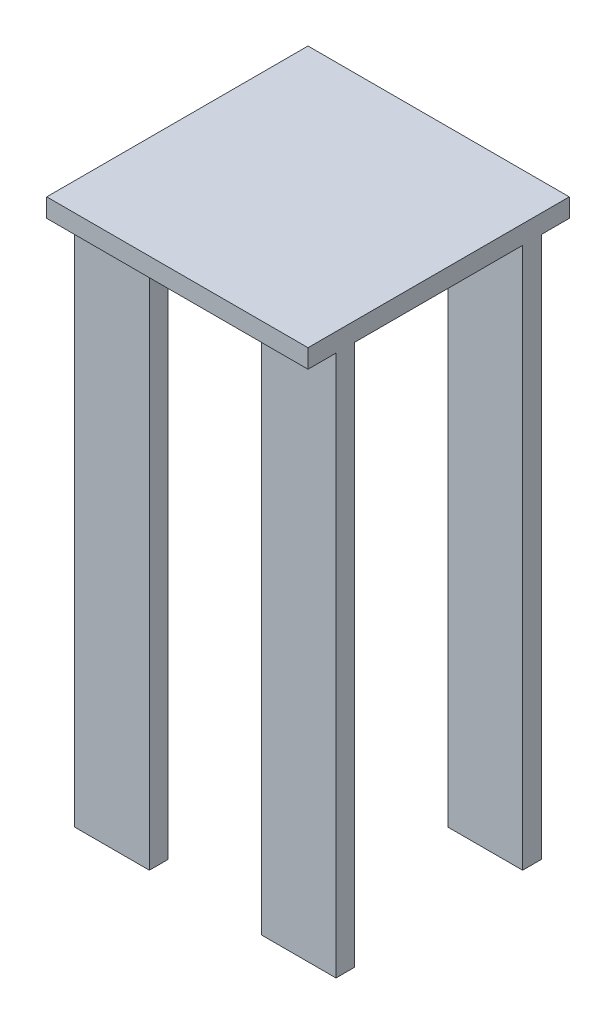
ISO-10303-21;
HEADER;
FILE_DESCRIPTION(('STEP AP214'),'2;1');
FILE_NAME('part.step','',(''),(''),'','','');
FILE_SCHEMA(('AUTOMOTIVE_DESIGN { 1 0 10303 214 1 1 1 1 }'));
ENDSEC;
DATA;
#1=APPLICATION_CONTEXT('core data for automotive mechanical design processes');
#2=APPLICATION_PROTOCOL_DEFINITION('international standard','automotive_design',2000,#1);
#3=PRODUCT_CONTEXT('',#1,'mechanical');
#4=PRODUCT('Part','Part','',(#3));
#5=PRODUCT_RELATED_PRODUCT_CATEGORY('part','',(#4));
#6=PRODUCT_DEFINITION_FORMATION('','',#4);
#7=PRODUCT_DEFINITION_CONTEXT('part definition',#1,'design');
#8=PRODUCT_DEFINITION('design','',#6,#7);
#9=PRODUCT_DEFINITION_SHAPE('','',#8);
#10=(LENGTH_UNIT() NAMED_UNIT(*) SI_UNIT(.MILLI.,.METRE.));
#11=(NAMED_UNIT(*) PLANE_ANGLE_UNIT() SI_UNIT($,.RADIAN.));
#12=(NAMED_UNIT(*) SI_UNIT($,.STERADIAN.) SOLID_ANGLE_UNIT());
#13=UNCERTAINTY_MEASURE_WITH_UNIT(LENGTH_MEASURE(1.E-05),#10,'distance_accuracy_value','');
#14=(GEOMETRIC_REPRESENTATION_CONTEXT(3) GLOBAL_UNCERTAINTY_ASSIGNED_CONTEXT((#13)) GLOBAL_UNIT_ASSIGNED_CONTEXT((#10,
#11,#12)) REPRESENTATION_CONTEXT('',''));
#15=CARTESIAN_POINT('',(0.,0.,0.));
#16=DIRECTION('',(0.,0.,1.));
#17=DIRECTION('',(1.,0.,0.));
#18=AXIS2_PLACEMENT_3D('',#15,#16,#17);
#19=CARTESIAN_POINT('',(-0.381,-3.175,-0.5715));
#20=DIRECTION('',(1.,0.,0.));
#21=DIRECTION('',(0.,0.,-1.));
#22=AXIS2_PLACEMENT_3D('',#19,#20,#21);
#23=PLANE('',#22);
#24=DIRECTION('',(0.,0.,-1.));
#25=VECTOR('',#24,1.);
#26=CARTESIAN_POINT('',(-0.381,0.635,-0.5715));
#27=LINE('',#26,#25);
#28=CARTESIAN_POINT('',(-0.381,0.635,-0.6985));
#29=VERTEX_POINT('',#28);
#30=CARTESIAN_POINT('',(-0.381,0.635,-0.5715));
#31=VERTEX_POINT('',#30);
#32=EDGE_CURVE('E20',#29,#31,#27,.F.);
#33=ORIENTED_EDGE('',*,*,#32,.T.);
#34=DIRECTION('',(0.,1.,0.));
#35=VECTOR('',#34,1.);
#36=CARTESIAN_POINT('',(-0.381,-3.175,-0.5715));
#37=LINE('',#36,#35);
#38=CARTESIAN_POINT('',(-0.381,-3.048,-0.5715));
#39=VERTEX_POINT('',#38);
#40=EDGE_CURVE('E160',#39,#31,#37,.T.);
#41=ORIENTED_EDGE('',*,*,#40,.F.);
#42=DIRECTION('',(0.,0.,1.));
#43=VECTOR('',#42,1.);
#44=CARTESIAN_POINT('',(-0.381,-3.048,0.));
#45=LINE('',#44,#43);
#46=CARTESIAN_POINT('',(-0.381,-3.048,-0.6985));
#47=VERTEX_POINT('',#46);
#48=EDGE_CURVE('E152',#39,#47,#45,.F.);
#49=ORIENTED_EDGE('',*,*,#48,.T.);
#50=DIRECTION('',(0.,1.,0.));
#51=VECTOR('',#50,1.);
#52=CARTESIAN_POINT('',(-0.381,-3.175,-0.6985));
#53=LINE('',#52,#51);
#54=EDGE_CURVE('E157',#29,#47,#53,.F.);
#55=ORIENTED_EDGE('',*,*,#54,.F.);
#56=EDGE_LOOP('',(#33,#41,#49,#55));
#57=FACE_BOUND('',#56,.T.);
#58=ADVANCED_FACE('F17',(#57),#23,.T.);
#59=CARTESIAN_POINT('',(-0.381,-3.175,0.6985));
#60=DIRECTION('',(1.,0.,0.));
#61=DIRECTION('',(0.,0.,-1.));
#62=AXIS2_PLACEMENT_3D('',#59,#60,#61);
#63=PLANE('',#62);
#64=DIRECTION('',(0.,0.,-1.));
#65=VECTOR('',#64,1.);
#66=CARTESIAN_POINT('',(-0.381,0.635,0.6985));
#67=LINE('',#66,#65);
#68=CARTESIAN_POINT('',(-0.381,0.635,0.5715));
#69=VERTEX_POINT('',#68);
#70=CARTESIAN_POINT('',(-0.381,0.635,0.6985));
#71=VERTEX_POINT('',#70);
#72=EDGE_CURVE('E169',#69,#71,#67,.F.);
#73=ORIENTED_EDGE('',*,*,#72,.T.);
#74=DIRECTION('',(0.,1.,0.));
#75=VECTOR('',#74,1.);
#76=CARTESIAN_POINT('',(-0.381,-3.175,0.6985));
#77=LINE('',#76,#75);
#78=CARTESIAN_POINT('',(-0.381,-3.048,0.6985));
#79=VERTEX_POINT('',#78);
#80=EDGE_CURVE('E218',#79,#71,#77,.T.);
#81=ORIENTED_EDGE('',*,*,#80,.F.);
#82=DIRECTION('',(0.,0.,1.));
#83=VECTOR('',#82,1.);
#84=CARTESIAN_POINT('',(-0.381,-3.048,0.));
#85=LINE('',#84,#83);
#86=CARTESIAN_POINT('',(-0.381,-3.048,0.5715));
#87=VERTEX_POINT('',#86);
#88=EDGE_CURVE('E225',#79,#87,#85,.F.);
#89=ORIENTED_EDGE('',*,*,#88,.T.);
#90=DIRECTION('',(0.,1.,0.));
#91=VECTOR('',#90,1.);
#92=CARTESIAN_POINT('',(-0.381,-3.175,0.5715));
#93=LINE('',#92,#91);
#94=EDGE_CURVE('E190',#69,#87,#93,.F.);
#95=ORIENTED_EDGE('',*,*,#94,.F.);
#96=EDGE_LOOP('',(#73,#81,#89,#95));
#97=FACE_BOUND('',#96,.T.);
#98=ADVANCED_FACE('F556',(#97),#63,.T.);
#99=CARTESIAN_POINT('',(0.381,-3.175,0.5715));
#100=DIRECTION('',(-1.,0.,0.));
#101=DIRECTION('',(0.,0.,1.));
#102=AXIS2_PLACEMENT_3D('',#99,#100,#101);
#103=PLANE('',#102);
#104=DIRECTION('',(0.,0.,1.));
#105=VECTOR('',#104,1.);
#106=CARTESIAN_POINT('',(0.381,0.635,0.));
#107=LINE('',#106,#105);
#108=CARTESIAN_POINT('',(0.381,0.635,0.6985));
#109=VERTEX_POINT('',#108);
#110=CARTESIAN_POINT('',(0.381,0.635,0.5715));
#111=VERTEX_POINT('',#110);
#112=EDGE_CURVE('E209',#109,#111,#107,.F.);
#113=ORIENTED_EDGE('',*,*,#112,.T.);
#114=DIRECTION('',(0.,1.,0.));
#115=VECTOR('',#114,1.);
#116=CARTESIAN_POINT('',(0.381,-3.175,0.5715));
#117=LINE('',#116,#115);
#118=CARTESIAN_POINT('',(0.381,-3.048,0.5715));
#119=VERTEX_POINT('',#118);
#120=EDGE_CURVE('E287',#119,#111,#117,.T.);
#121=ORIENTED_EDGE('',*,*,#120,.F.);
#122=DIRECTION('',(0.,0.,1.));
#123=VECTOR('',#122,1.);
#124=CARTESIAN_POINT('',(0.381,-3.048,0.));
#125=LINE('',#124,#123);
#126=CARTESIAN_POINT('',(0.381,-3.048,0.6985));
#127=VERTEX_POINT('',#126);
#128=EDGE_CURVE('E295',#119,#127,#125,.T.);
#129=ORIENTED_EDGE('',*,*,#128,.T.);
#130=DIRECTION('',(0.,1.,0.));
#131=VECTOR('',#130,1.);
#132=CARTESIAN_POINT('',(0.381,-3.175,0.6985));
#133=LINE('',#132,#131);
#134=EDGE_CURVE('E198',#109,#127,#133,.F.);
#135=ORIENTED_EDGE('',*,*,#134,.F.);
#136=EDGE_LOOP('',(#113,#121,#129,#135));
#137=FACE_BOUND('',#136,.T.);
#138=ADVANCED_FACE('F546',(#137),#103,.T.);
#139=CARTESIAN_POINT('',(0.381,-3.175,-0.6985));
#140=DIRECTION('',(-1.,0.,0.));
#141=DIRECTION('',(0.,0.,1.));
#142=AXIS2_PLACEMENT_3D('',#139,#140,#141);
#143=PLANE('',#142);
#144=DIRECTION('',(0.,0.,1.));
#145=VECTOR('',#144,1.);
#146=CARTESIAN_POINT('',(0.381,0.635,0.));
#147=LINE('',#146,#145);
#148=CARTESIAN_POINT('',(0.381,0.635,-0.5715));
#149=VERTEX_POINT('',#148);
#150=CARTESIAN_POINT('',(0.381,0.635,-0.6985));
#151=VERTEX_POINT('',#150);
#152=EDGE_CURVE('E205',#149,#151,#147,.F.);
#153=ORIENTED_EDGE('',*,*,#152,.T.);
#154=DIRECTION('',(0.,1.,0.));
#155=VECTOR('',#154,1.);
#156=CARTESIAN_POINT('',(0.381,-3.175,-0.6985));
#157=LINE('',#156,#155);
#158=CARTESIAN_POINT('',(0.381,-3.048,-0.6985));
#159=VERTEX_POINT('',#158);
#160=EDGE_CURVE('E268',#159,#151,#157,.T.);
#161=ORIENTED_EDGE('',*,*,#160,.F.);
#162=DIRECTION('',(0.,0.,1.));
#163=VECTOR('',#162,1.);
#164=CARTESIAN_POINT('',(0.381,-3.048,0.));
#165=LINE('',#164,#163);
#166=CARTESIAN_POINT('',(0.381,-3.048,-0.5715));
#167=VERTEX_POINT('',#166);
#168=EDGE_CURVE('E276',#159,#167,#165,.T.);
#169=ORIENTED_EDGE('',*,*,#168,.T.);
#170=DIRECTION('',(0.,1.,0.));
#171=VECTOR('',#170,1.);
#172=CARTESIAN_POINT('',(0.381,-3.175,-0.5715));
#173=LINE('',#172,#171);
#174=EDGE_CURVE('E278',#149,#167,#173,.F.);
#175=ORIENTED_EDGE('',*,*,#174,.F.);
#176=EDGE_LOOP('',(#153,#161,#169,#175));
#177=FACE_BOUND('',#176,.T.);
#178=ADVANCED_FACE('F537',(#177),#143,.T.);
#179=CARTESIAN_POINT('',(-0.381,-3.175,-0.6985));
#180=DIRECTION('',(0.,0.,-1.));
#181=DIRECTION('',(-1.,0.,0.));
#182=AXIS2_PLACEMENT_3D('',#179,#180,#181);
#183=PLANE('',#182);
#184=DIRECTION('',(1.,0.,0.));
#185=VECTOR('',#184,1.);
#186=CARTESIAN_POINT('',(0.,0.635,-0.6985));
#187=LINE('',#186,#185);
#188=CARTESIAN_POINT('',(-0.889,0.635,-0.6985));
#189=VERTEX_POINT('',#188);
#190=EDGE_CURVE('E168',#189,#29,#187,.T.);
#191=ORIENTED_EDGE('',*,*,#190,.T.);
#192=ORIENTED_EDGE('',*,*,#54,.T.);
#193=DIRECTION('',(1.,0.,0.));
#194=VECTOR('',#193,1.);
#195=CARTESIAN_POINT('',(0.,-3.048,-0.6985));
#196=LINE('',#195,#194);
#197=CARTESIAN_POINT('',(-0.889,-3.048,-0.6985));
#198=VERTEX_POINT('',#197);
#199=EDGE_CURVE('E162',#47,#198,#196,.F.);
#200=ORIENTED_EDGE('',*,*,#199,.T.);
#201=DIRECTION('',(0.,1.,0.));
#202=VECTOR('',#201,1.);
#203=CARTESIAN_POINT('',(-0.889,-3.048,-0.6985));
#204=LINE('',#203,#202);
#205=EDGE_CURVE('E252',#189,#198,#204,.F.);
#206=ORIENTED_EDGE('',*,*,#205,.F.);
#207=EDGE_LOOP('',(#191,#192,#200,#206));
#208=FACE_BOUND('',#207,.T.);
#209=ADVANCED_FACE('F165',(#208),#183,.T.);
#210=CARTESIAN_POINT('',(0.,-3.048,0.));
#211=DIRECTION('',(0.,1.,0.));
#212=DIRECTION('',(0.,0.,1.));
#213=AXIS2_PLACEMENT_3D('',#210,#211,#212);
#214=PLANE('',#213);
#215=ORIENTED_EDGE('',*,*,#48,.F.);
#216=DIRECTION('',(1.,0.,0.));
#217=VECTOR('',#216,1.);
#218=CARTESIAN_POINT('',(-0.889,-3.048,-0.5715));
#219=LINE('',#218,#217);
#220=CARTESIAN_POINT('',(-0.889,-3.048,-0.5715));
#221=VERTEX_POINT('',#220);
#222=EDGE_CURVE('E175',#221,#39,#219,.T.);
#223=ORIENTED_EDGE('',*,*,#222,.F.);
#224=DIRECTION('',(0.,0.,1.));
#225=VECTOR('',#224,1.);
#226=CARTESIAN_POINT('',(-0.889,-3.048,-0.889));
#227=LINE('',#226,#225);
#228=EDGE_CURVE('E173',#198,#221,#227,.T.);
#229=ORIENTED_EDGE('',*,*,#228,.F.);
#230=ORIENTED_EDGE('',*,*,#199,.F.);
#231=EDGE_LOOP('',(#215,#223,#229,#230));
#232=FACE_BOUND('',#231,.T.);
#233=ADVANCED_FACE('F171',(#232),#214,.F.);
#234=CARTESIAN_POINT('',(-0.889,-3.175,-0.5715));
#235=DIRECTION('',(0.,0.,1.));
#236=DIRECTION('',(1.,0.,0.));
#237=AXIS2_PLACEMENT_3D('',#234,#235,#236);
#238=PLANE('',#237);
#239=DIRECTION('',(1.,0.,0.));
#240=VECTOR('',#239,1.);
#241=CARTESIAN_POINT('',(0.,0.635,-0.5715));
#242=LINE('',#241,#240);
#243=CARTESIAN_POINT('',(-0.889,0.635,-0.5715));
#244=VERTEX_POINT('',#243);
#245=EDGE_CURVE('E188',#31,#244,#242,.F.);
#246=ORIENTED_EDGE('',*,*,#245,.T.);
#247=DIRECTION('',(0.,1.,0.));
#248=VECTOR('',#247,1.);
#249=CARTESIAN_POINT('',(-0.889,-3.048,-0.5715));
#250=LINE('',#249,#248);
#251=EDGE_CURVE('E246',#221,#244,#250,.T.);
#252=ORIENTED_EDGE('',*,*,#251,.F.);
#253=ORIENTED_EDGE('',*,*,#222,.T.);
#254=ORIENTED_EDGE('',*,*,#40,.T.);
#255=EDGE_LOOP('',(#246,#252,#253,#254));
#256=FACE_BOUND('',#255,.T.);
#257=ADVANCED_FACE('F186',(#256),#238,.T.);
#258=CARTESIAN_POINT('',(-0.381,-3.175,0.5715));
#259=DIRECTION('',(0.,0.,-1.));
#260=DIRECTION('',(-1.,0.,0.));
#261=AXIS2_PLACEMENT_3D('',#258,#259,#260);
#262=PLANE('',#261);
#263=DIRECTION('',(1.,0.,0.));
#264=VECTOR('',#263,1.);
#265=CARTESIAN_POINT('',(0.,0.635,0.5715));
#266=LINE('',#265,#264);
#267=CARTESIAN_POINT('',(-0.889,0.635,0.5715));
#268=VERTEX_POINT('',#267);
#269=EDGE_CURVE('E215',#268,#69,#266,.T.);
#270=ORIENTED_EDGE('',*,*,#269,.T.);
#271=ORIENTED_EDGE('',*,*,#94,.T.);
#272=DIRECTION('',(1.,0.,0.));
#273=VECTOR('',#272,1.);
#274=CARTESIAN_POINT('',(0.,-3.048,0.5715));
#275=LINE('',#274,#273);
#276=CARTESIAN_POINT('',(-0.889,-3.048,0.5715));
#277=VERTEX_POINT('',#276);
#278=EDGE_CURVE('E223',#87,#277,#275,.F.);
#279=ORIENTED_EDGE('',*,*,#278,.T.);
#280=DIRECTION('',(0.,1.,0.));
#281=VECTOR('',#280,1.);
#282=CARTESIAN_POINT('',(-0.889,-3.048,0.5715));
#283=LINE('',#282,#281);
#284=EDGE_CURVE('E242',#268,#277,#283,.F.);
#285=ORIENTED_EDGE('',*,*,#284,.F.);
#286=EDGE_LOOP('',(#270,#271,#279,#285));
#287=FACE_BOUND('',#286,.T.);
#288=ADVANCED_FACE('F230',(#287),#262,.T.);
#289=CARTESIAN_POINT('',(0.,-3.048,0.));
#290=DIRECTION('',(0.,1.,0.));
#291=DIRECTION('',(0.,0.,1.));
#292=AXIS2_PLACEMENT_3D('',#289,#290,#291);
#293=PLANE('',#292);
#294=ORIENTED_EDGE('',*,*,#88,.F.);
#295=DIRECTION('',(1.,0.,0.));
#296=VECTOR('',#295,1.);
#297=CARTESIAN_POINT('',(-0.889,-3.048,0.6985));
#298=LINE('',#297,#296);
#299=CARTESIAN_POINT('',(-0.889,-3.048,0.6985));
#300=VERTEX_POINT('',#299);
#301=EDGE_CURVE('E220',#300,#79,#298,.T.);
#302=ORIENTED_EDGE('',*,*,#301,.F.);
#303=DIRECTION('',(0.,0.,1.));
#304=VECTOR('',#303,1.);
#305=CARTESIAN_POINT('',(-0.889,-3.048,-0.889));
#306=LINE('',#305,#304);
#307=EDGE_CURVE('E236',#277,#300,#306,.T.);
#308=ORIENTED_EDGE('',*,*,#307,.F.);
#309=ORIENTED_EDGE('',*,*,#278,.F.);
#310=EDGE_LOOP('',(#294,#302,#308,#309));
#311=FACE_BOUND('',#310,.T.);
#312=ADVANCED_FACE('F234',(#311),#293,.F.);
#313=CARTESIAN_POINT('',(-0.889,-3.175,0.6985));
#314=DIRECTION('',(0.,0.,1.));
#315=DIRECTION('',(1.,0.,0.));
#316=AXIS2_PLACEMENT_3D('',#313,#314,#315);
#317=PLANE('',#316);
#318=DIRECTION('',(1.,0.,0.));
#319=VECTOR('',#318,1.);
#320=CARTESIAN_POINT('',(0.,0.635,0.6985));
#321=LINE('',#320,#319);
#322=CARTESIAN_POINT('',(-0.889,0.635,0.6985));
#323=VERTEX_POINT('',#322);
#324=EDGE_CURVE('E213',#71,#323,#321,.F.);
#325=ORIENTED_EDGE('',*,*,#324,.T.);
#326=DIRECTION('',(0.,1.,0.));
#327=VECTOR('',#326,1.);
#328=CARTESIAN_POINT('',(-0.889,-3.048,0.6985));
#329=LINE('',#328,#327);
#330=EDGE_CURVE('E241',#300,#323,#329,.T.);
#331=ORIENTED_EDGE('',*,*,#330,.F.);
#332=ORIENTED_EDGE('',*,*,#301,.T.);
#333=ORIENTED_EDGE('',*,*,#80,.T.);
#334=EDGE_LOOP('',(#325,#331,#332,#333));
#335=FACE_BOUND('',#334,.T.);
#336=ADVANCED_FACE('F332',(#335),#317,.T.);
#337=CARTESIAN_POINT('',(0.,0.635,0.));
#338=DIRECTION('',(0.,1.,0.));
#339=DIRECTION('',(0.,0.,1.));
#340=AXIS2_PLACEMENT_3D('',#337,#338,#339);
#341=PLANE('',#340);
#342=ORIENTED_EDGE('',*,*,#245,.F.);
#343=ORIENTED_EDGE('',*,*,#32,.F.);
#344=ORIENTED_EDGE('',*,*,#190,.F.);
#345=DIRECTION('',(0.,0.,1.));
#346=VECTOR('',#345,1.);
#347=CARTESIAN_POINT('',(-0.889,0.635,-0.889));
#348=LINE('',#347,#346);
#349=CARTESIAN_POINT('',(-0.889,0.635,-0.889));
#350=VERTEX_POINT('',#349);
#351=EDGE_CURVE('E254',#350,#189,#348,.T.);
#352=ORIENTED_EDGE('',*,*,#351,.F.);
#353=DIRECTION('',(-1.,0.,0.));
#354=VECTOR('',#353,1.);
#355=CARTESIAN_POINT('',(0.889,0.635,-0.889));
#356=LINE('',#355,#354);
#357=CARTESIAN_POINT('',(0.889,0.635,-0.889));
#358=VERTEX_POINT('',#357);
#359=EDGE_CURVE('E263',#358,#350,#356,.T.);
#360=ORIENTED_EDGE('',*,*,#359,.F.);
#361=DIRECTION('',(0.,0.,1.));
#362=VECTOR('',#361,1.);
#363=CARTESIAN_POINT('',(0.889,0.635,0.));
#364=LINE('',#363,#362);
#365=CARTESIAN_POINT('',(0.889,0.635,-0.6985));
#366=VERTEX_POINT('',#365);
#367=EDGE_CURVE('E200',#366,#358,#364,.F.);
#368=ORIENTED_EDGE('',*,*,#367,.F.);
#369=DIRECTION('',(-1.,0.,0.));
#370=VECTOR('',#369,1.);
#371=CARTESIAN_POINT('',(0.889,0.635,-0.6985));
#372=LINE('',#371,#370);
#373=EDGE_CURVE('E265',#151,#366,#372,.F.);
#374=ORIENTED_EDGE('',*,*,#373,.F.);
#375=ORIENTED_EDGE('',*,*,#152,.F.);
#376=DIRECTION('',(1.,0.,0.));
#377=VECTOR('',#376,1.);
#378=CARTESIAN_POINT('',(0.381,0.635,-0.5715));
#379=LINE('',#378,#377);
#380=CARTESIAN_POINT('',(0.889,0.635,-0.5715));
#381=VERTEX_POINT('',#380);
#382=EDGE_CURVE('E281',#381,#149,#379,.F.);
#383=ORIENTED_EDGE('',*,*,#382,.F.);
#384=DIRECTION('',(0.,0.,1.));
#385=VECTOR('',#384,1.);
#386=CARTESIAN_POINT('',(0.889,0.635,0.));
#387=LINE('',#386,#385);
#388=CARTESIAN_POINT('',(0.889,0.635,0.5715));
#389=VERTEX_POINT('',#388);
#390=EDGE_CURVE('E207',#389,#381,#387,.F.);
#391=ORIENTED_EDGE('',*,*,#390,.F.);
#392=DIRECTION('',(-1.,0.,0.));
#393=VECTOR('',#392,1.);
#394=CARTESIAN_POINT('',(0.889,0.635,0.5715));
#395=LINE('',#394,#393);
#396=EDGE_CURVE('E284',#111,#389,#395,.F.);
#397=ORIENTED_EDGE('',*,*,#396,.F.);
#398=ORIENTED_EDGE('',*,*,#112,.F.);
#399=DIRECTION('',(1.,0.,0.));
#400=VECTOR('',#399,1.);
#401=CARTESIAN_POINT('',(0.381,0.635,0.6985));
#402=LINE('',#401,#400);
#403=CARTESIAN_POINT('',(0.889,0.635,0.6985));
#404=VERTEX_POINT('',#403);
#405=EDGE_CURVE('E195',#404,#109,#402,.F.);
#406=ORIENTED_EDGE('',*,*,#405,.F.);
#407=DIRECTION('',(0.,0.,1.));
#408=VECTOR('',#407,1.);
#409=CARTESIAN_POINT('',(0.889,0.635,0.));
#410=LINE('',#409,#408);
#411=CARTESIAN_POINT('',(0.889,0.635,0.889));
#412=VERTEX_POINT('',#411);
#413=EDGE_CURVE('E211',#412,#404,#410,.F.);
#414=ORIENTED_EDGE('',*,*,#413,.F.);
#415=DIRECTION('',(1.,0.,0.));
#416=VECTOR('',#415,1.);
#417=CARTESIAN_POINT('',(-0.889,0.635,0.889));
#418=LINE('',#417,#416);
#419=CARTESIAN_POINT('',(-0.889,0.635,0.889));
#420=VERTEX_POINT('',#419);
#421=EDGE_CURVE('E329',#420,#412,#418,.T.);
#422=ORIENTED_EDGE('',*,*,#421,.F.);
#423=DIRECTION('',(0.,0.,1.));
#424=VECTOR('',#423,1.);
#425=CARTESIAN_POINT('',(-0.889,0.635,-0.889));
#426=LINE('',#425,#424);
#427=EDGE_CURVE('E260',#323,#420,#426,.T.);
#428=ORIENTED_EDGE('',*,*,#427,.F.);
#429=ORIENTED_EDGE('',*,*,#324,.F.);
#430=ORIENTED_EDGE('',*,*,#72,.F.);
#431=ORIENTED_EDGE('',*,*,#269,.F.);
#432=DIRECTION('',(0.,0.,1.));
#433=VECTOR('',#432,1.);
#434=CARTESIAN_POINT('',(-0.889,0.635,-0.889));
#435=LINE('',#434,#433);
#436=EDGE_CURVE('E193',#244,#268,#435,.T.);
#437=ORIENTED_EDGE('',*,*,#436,.F.);
#438=EDGE_LOOP('',(#342,#343,#344,#352,#360,#368,#374,#375,#383,#391,#397,#398,#406,#414,#422,
#428,#429,#430,#431,#437));
#439=FACE_BOUND('',#438,.T.);
#440=ADVANCED_FACE('F191',(#439),#341,.F.);
#441=CARTESIAN_POINT('',(0.381,-3.175,0.6985));
#442=DIRECTION('',(0.,0.,1.));
#443=DIRECTION('',(1.,0.,0.));
#444=AXIS2_PLACEMENT_3D('',#441,#442,#443);
#445=PLANE('',#444);
#446=ORIENTED_EDGE('',*,*,#405,.T.);
#447=ORIENTED_EDGE('',*,*,#134,.T.);
#448=DIRECTION('',(1.,0.,0.));
#449=VECTOR('',#448,1.);
#450=CARTESIAN_POINT('',(0.,-3.048,0.6985));
#451=LINE('',#450,#449);
#452=CARTESIAN_POINT('',(0.889,-3.048,0.6985));
#453=VERTEX_POINT('',#452);
#454=EDGE_CURVE('E293',#127,#453,#451,.T.);
#455=ORIENTED_EDGE('',*,*,#454,.T.);
#456=DIRECTION('',(0.,1.,0.));
#457=VECTOR('',#456,1.);
#458=CARTESIAN_POINT('',(0.889,-3.048,0.6985));
#459=LINE('',#458,#457);
#460=EDGE_CURVE('E315',#404,#453,#459,.F.);
#461=ORIENTED_EDGE('',*,*,#460,.F.);
#462=EDGE_LOOP('',(#446,#447,#455,#461));
#463=FACE_BOUND('',#462,.T.);
#464=ADVANCED_FACE('F300',(#463),#445,.T.);
#465=CARTESIAN_POINT('',(0.,-3.048,0.));
#466=DIRECTION('',(0.,1.,0.));
#467=DIRECTION('',(0.,0.,1.));
#468=AXIS2_PLACEMENT_3D('',#465,#466,#467);
#469=PLANE('',#468);
#470=DIRECTION('',(0.,0.,-1.));
#471=VECTOR('',#470,1.);
#472=CARTESIAN_POINT('',(0.889,-3.048,0.889));
#473=LINE('',#472,#471);
#474=CARTESIAN_POINT('',(0.889,-3.048,0.5715));
#475=VERTEX_POINT('',#474);
#476=EDGE_CURVE('E309',#453,#475,#473,.T.);
#477=ORIENTED_EDGE('',*,*,#476,.F.);
#478=ORIENTED_EDGE('',*,*,#454,.F.);
#479=ORIENTED_EDGE('',*,*,#128,.F.);
#480=DIRECTION('',(-1.,0.,0.));
#481=VECTOR('',#480,1.);
#482=CARTESIAN_POINT('',(0.889,-3.048,0.5715));
#483=LINE('',#482,#481);
#484=EDGE_CURVE('E290',#475,#119,#483,.T.);
#485=ORIENTED_EDGE('',*,*,#484,.F.);
#486=EDGE_LOOP('',(#477,#478,#479,#485));
#487=FACE_BOUND('',#486,.T.);
#488=ADVANCED_FACE('F306',(#487),#469,.F.);
#489=CARTESIAN_POINT('',(0.889,-3.175,0.5715));
#490=DIRECTION('',(0.,0.,-1.));
#491=DIRECTION('',(-1.,0.,0.));
#492=AXIS2_PLACEMENT_3D('',#489,#490,#491);
#493=PLANE('',#492);
#494=ORIENTED_EDGE('',*,*,#396,.T.);
#495=DIRECTION('',(0.,1.,0.));
#496=VECTOR('',#495,1.);
#497=CARTESIAN_POINT('',(0.889,-3.048,0.5715));
#498=LINE('',#497,#496);
#499=EDGE_CURVE('E314',#475,#389,#498,.T.);
#500=ORIENTED_EDGE('',*,*,#499,.F.);
#501=ORIENTED_EDGE('',*,*,#484,.T.);
#502=ORIENTED_EDGE('',*,*,#120,.T.);
#503=EDGE_LOOP('',(#494,#500,#501,#502));
#504=FACE_BOUND('',#503,.T.);
#505=ADVANCED_FACE('F357',(#504),#493,.T.);
#506=CARTESIAN_POINT('',(0.381,-3.175,-0.5715));
#507=DIRECTION('',(0.,0.,1.));
#508=DIRECTION('',(1.,0.,0.));
#509=AXIS2_PLACEMENT_3D('',#506,#507,#508);
#510=PLANE('',#509);
#511=ORIENTED_EDGE('',*,*,#382,.T.);
#512=ORIENTED_EDGE('',*,*,#174,.T.);
#513=DIRECTION('',(1.,0.,0.));
#514=VECTOR('',#513,1.);
#515=CARTESIAN_POINT('',(0.,-3.048,-0.5715));
#516=LINE('',#515,#514);
#517=CARTESIAN_POINT('',(0.889,-3.048,-0.5715));
#518=VERTEX_POINT('',#517);
#519=EDGE_CURVE('E274',#167,#518,#516,.T.);
#520=ORIENTED_EDGE('',*,*,#519,.T.);
#521=DIRECTION('',(0.,1.,0.));
#522=VECTOR('',#521,1.);
#523=CARTESIAN_POINT('',(0.889,-3.048,-0.5715));
#524=LINE('',#523,#522);
#525=EDGE_CURVE('E353',#381,#518,#524,.F.);
#526=ORIENTED_EDGE('',*,*,#525,.F.);
#527=EDGE_LOOP('',(#511,#512,#520,#526));
#528=FACE_BOUND('',#527,.T.);
#529=ADVANCED_FACE('F363',(#528),#510,.T.);
#530=CARTESIAN_POINT('',(0.,-3.048,0.));
#531=DIRECTION('',(0.,1.,0.));
#532=DIRECTION('',(0.,0.,1.));
#533=AXIS2_PLACEMENT_3D('',#530,#531,#532);
#534=PLANE('',#533);
#535=DIRECTION('',(0.,0.,-1.));
#536=VECTOR('',#535,1.);
#537=CARTESIAN_POINT('',(0.889,-3.048,0.889));
#538=LINE('',#537,#536);
#539=CARTESIAN_POINT('',(0.889,-3.048,-0.6985));
#540=VERTEX_POINT('',#539);
#541=EDGE_CURVE('E351',#518,#540,#538,.T.);
#542=ORIENTED_EDGE('',*,*,#541,.F.);
#543=ORIENTED_EDGE('',*,*,#519,.F.);
#544=ORIENTED_EDGE('',*,*,#168,.F.);
#545=DIRECTION('',(-1.,0.,0.));
#546=VECTOR('',#545,1.);
#547=CARTESIAN_POINT('',(0.889,-3.048,-0.6985));
#548=LINE('',#547,#546);
#549=EDGE_CURVE('E271',#540,#159,#548,.T.);
#550=ORIENTED_EDGE('',*,*,#549,.F.);
#551=EDGE_LOOP('',(#542,#543,#544,#550));
#552=FACE_BOUND('',#551,.T.);
#553=ADVANCED_FACE('F368',(#552),#534,.F.);
#554=CARTESIAN_POINT('',(0.889,-3.175,-0.6985));
#555=DIRECTION('',(0.,0.,-1.));
#556=DIRECTION('',(-1.,0.,0.));
#557=AXIS2_PLACEMENT_3D('',#554,#555,#556);
#558=PLANE('',#557);
#559=ORIENTED_EDGE('',*,*,#373,.T.);
#560=DIRECTION('',(0.,1.,0.));
#561=VECTOR('',#560,1.);
#562=CARTESIAN_POINT('',(0.889,-3.048,-0.6985));
#563=LINE('',#562,#561);
#564=EDGE_CURVE('E348',#540,#366,#563,.T.);
#565=ORIENTED_EDGE('',*,*,#564,.F.);
#566=ORIENTED_EDGE('',*,*,#549,.T.);
#567=ORIENTED_EDGE('',*,*,#160,.T.);
#568=EDGE_LOOP('',(#559,#565,#566,#567));
#569=FACE_BOUND('',#568,.T.);
#570=ADVANCED_FACE('F371',(#569),#558,.T.);
#571=CARTESIAN_POINT('',(0.889,-3.048,-0.889));
#572=DIRECTION('',(0.,0.,-1.));
#573=DIRECTION('',(-1.,0.,0.));
#574=AXIS2_PLACEMENT_3D('',#571,#572,#573);
#575=PLANE('',#574);
#576=DIRECTION('',(1.,0.,0.));
#577=VECTOR('',#576,1.);
#578=CARTESIAN_POINT('',(0.,0.762,-0.889));
#579=LINE('',#578,#577);
#580=CARTESIAN_POINT('',(0.889,0.762,-0.889));
#581=VERTEX_POINT('',#580);
#582=CARTESIAN_POINT('',(-0.889,0.762,-0.889));
#583=VERTEX_POINT('',#582);
#584=EDGE_CURVE('E344',#581,#583,#579,.F.);
#585=ORIENTED_EDGE('',*,*,#584,.F.);
#586=DIRECTION('',(0.,1.,0.));
#587=VECTOR('',#586,1.);
#588=CARTESIAN_POINT('',(0.889,-3.048,-0.889));
#589=LINE('',#588,#587);
#590=EDGE_CURVE('E320',#358,#581,#589,.T.);
#591=ORIENTED_EDGE('',*,*,#590,.F.);
#592=ORIENTED_EDGE('',*,*,#359,.T.);
#593=DIRECTION('',(0.,1.,0.));
#594=VECTOR('',#593,1.);
#595=CARTESIAN_POINT('',(-0.889,-3.048,-0.889));
#596=LINE('',#595,#594);
#597=EDGE_CURVE('E257',#583,#350,#596,.F.);
#598=ORIENTED_EDGE('',*,*,#597,.F.);
#599=EDGE_LOOP('',(#585,#591,#592,#598));
#600=FACE_BOUND('',#599,.T.);
#601=ADVANCED_FACE('F375',(#600),#575,.T.);
#602=CARTESIAN_POINT('',(-0.889,-3.048,-0.889));
#603=DIRECTION('',(-1.,0.,0.));
#604=DIRECTION('',(0.,0.,1.));
#605=AXIS2_PLACEMENT_3D('',#602,#603,#604);
#606=PLANE('',#605);
#607=ORIENTED_EDGE('',*,*,#307,.T.);
#608=ORIENTED_EDGE('',*,*,#330,.T.);
#609=ORIENTED_EDGE('',*,*,#427,.T.);
#610=DIRECTION('',(0.,1.,0.));
#611=VECTOR('',#610,1.);
#612=CARTESIAN_POINT('',(-0.889,-3.048,0.889));
#613=LINE('',#612,#611);
#614=CARTESIAN_POINT('',(-0.889,0.762,0.889));
#615=VERTEX_POINT('',#614);
#616=EDGE_CURVE('E326',#615,#420,#613,.F.);
#617=ORIENTED_EDGE('',*,*,#616,.F.);
#618=DIRECTION('',(0.,0.,1.));
#619=VECTOR('',#618,1.);
#620=CARTESIAN_POINT('',(-0.889,0.762,0.));
#621=LINE('',#620,#619);
#622=EDGE_CURVE('E342',#583,#615,#621,.T.);
#623=ORIENTED_EDGE('',*,*,#622,.F.);
#624=ORIENTED_EDGE('',*,*,#597,.T.);
#625=ORIENTED_EDGE('',*,*,#351,.T.);
#626=ORIENTED_EDGE('',*,*,#205,.T.);
#627=ORIENTED_EDGE('',*,*,#228,.T.);
#628=ORIENTED_EDGE('',*,*,#251,.T.);
#629=ORIENTED_EDGE('',*,*,#436,.T.);
#630=ORIENTED_EDGE('',*,*,#284,.T.);
#631=EDGE_LOOP('',(#607,#608,#609,#617,#623,#624,#625,#626,#627,#628,#629,#630));
#632=FACE_BOUND('',#631,.T.);
#633=ADVANCED_FACE('F244',(#632),#606,.T.);
#634=CARTESIAN_POINT('',(-0.889,-3.048,0.889));
#635=DIRECTION('',(0.,0.,1.));
#636=DIRECTION('',(1.,0.,0.));
#637=AXIS2_PLACEMENT_3D('',#634,#635,#636);
#638=PLANE('',#637);
#639=DIRECTION('',(1.,0.,0.));
#640=VECTOR('',#639,1.);
#641=CARTESIAN_POINT('',(0.,0.762,0.889));
#642=LINE('',#641,#640);
#643=CARTESIAN_POINT('',(0.889,0.762,0.889));
#644=VERTEX_POINT('',#643);
#645=EDGE_CURVE('E26',#615,#644,#642,.T.);
#646=ORIENTED_EDGE('',*,*,#645,.F.);
#647=ORIENTED_EDGE('',*,*,#616,.T.);
#648=ORIENTED_EDGE('',*,*,#421,.T.);
#649=DIRECTION('',(0.,1.,0.));
#650=VECTOR('',#649,1.);
#651=CARTESIAN_POINT('',(0.889,-3.048,0.889));
#652=LINE('',#651,#650);
#653=EDGE_CURVE('E35',#644,#412,#652,.F.);
#654=ORIENTED_EDGE('',*,*,#653,.F.);
#655=EDGE_LOOP('',(#646,#647,#648,#654));
#656=FACE_BOUND('',#655,.T.);
#657=ADVANCED_FACE('F334',(#656),#638,.T.);
#658=CARTESIAN_POINT('',(0.889,-3.048,0.889));
#659=DIRECTION('',(1.,0.,0.));
#660=DIRECTION('',(0.,0.,-1.));
#661=AXIS2_PLACEMENT_3D('',#658,#659,#660);
#662=PLANE('',#661);
#663=ORIENTED_EDGE('',*,*,#541,.T.);
#664=ORIENTED_EDGE('',*,*,#564,.T.);
#665=ORIENTED_EDGE('',*,*,#367,.T.);
#666=ORIENTED_EDGE('',*,*,#590,.T.);
#667=DIRECTION('',(0.,0.,1.));
#668=VECTOR('',#667,1.);
#669=CARTESIAN_POINT('',(0.889,0.762,0.));
#670=LINE('',#669,#668);
#671=EDGE_CURVE('E11',#644,#581,#670,.F.);
#672=ORIENTED_EDGE('',*,*,#671,.F.);
#673=ORIENTED_EDGE('',*,*,#653,.T.);
#674=ORIENTED_EDGE('',*,*,#413,.T.);
#675=ORIENTED_EDGE('',*,*,#460,.T.);
#676=ORIENTED_EDGE('',*,*,#476,.T.);
#677=ORIENTED_EDGE('',*,*,#499,.T.);
#678=ORIENTED_EDGE('',*,*,#390,.T.);
#679=ORIENTED_EDGE('',*,*,#525,.T.);
#680=EDGE_LOOP('',(#663,#664,#665,#666,#672,#673,#674,#675,#676,#677,#678,#679));
#681=FACE_BOUND('',#680,.T.);
#682=ADVANCED_FACE('F318',(#681),#662,.T.);
#683=CARTESIAN_POINT('',(0.,0.762,0.));
#684=DIRECTION('',(0.,1.,0.));
#685=DIRECTION('',(0.,0.,1.));
#686=AXIS2_PLACEMENT_3D('',#683,#684,#685);
#687=PLANE('',#686);
#688=ORIENTED_EDGE('',*,*,#645,.T.);
#689=ORIENTED_EDGE('',*,*,#671,.T.);
#690=ORIENTED_EDGE('',*,*,#584,.T.);
#691=ORIENTED_EDGE('',*,*,#622,.T.);
#692=EDGE_LOOP('',(#688,#689,#690,#691));
#693=FACE_BOUND('',#692,.T.);
#694=ADVANCED_FACE('F340',(#693),#687,.T.);
#695=CLOSED_SHELL('',(#58,#98,#138,#178,#209,#233,#257,#288,#312,#336,#440,#464,#488,#505,#529,
#553,#570,#601,#633,#657,#682,#694));
#696=MANIFOLD_SOLID_BREP('B1',#695);
#697=ADVANCED_BREP_SHAPE_REPRESENTATION('',(#18,#696),#14);
#698=SHAPE_DEFINITION_REPRESENTATION(#9,#697);
ENDSEC;
END-ISO-10303-21;
